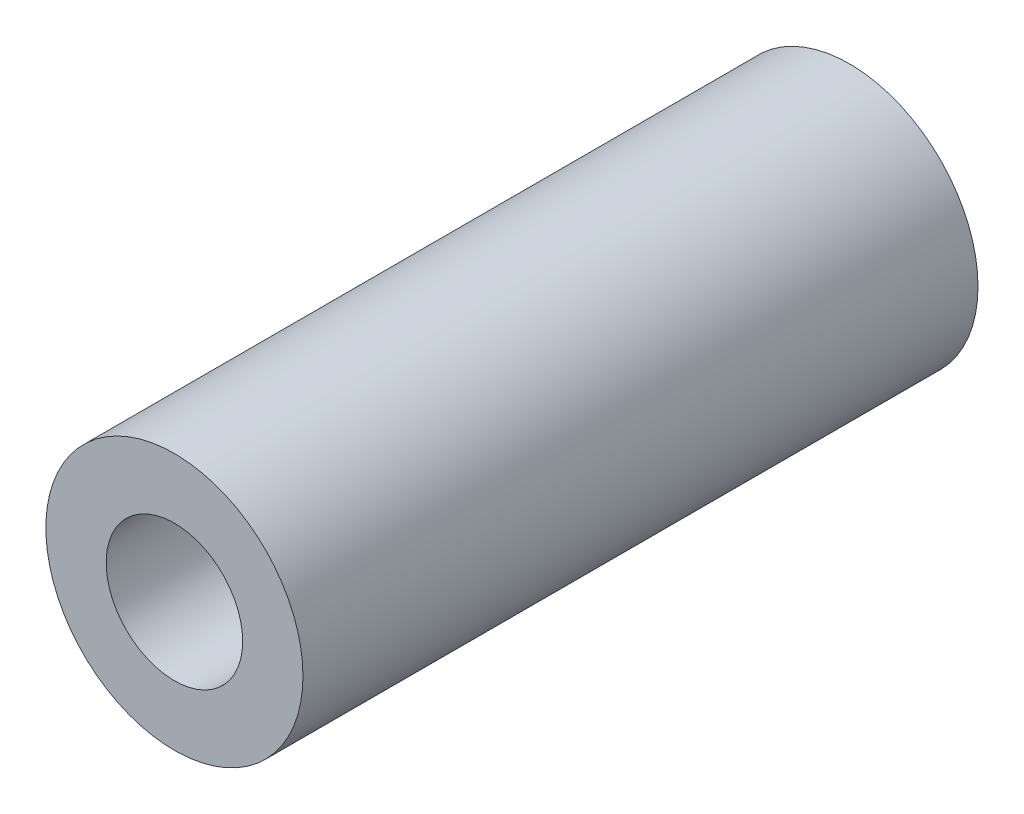
ISO-10303-21;
HEADER;
FILE_DESCRIPTION(('STEP AP214'),'2;1');
FILE_NAME('part.step','',(''),(''),'','','');
FILE_SCHEMA(('AUTOMOTIVE_DESIGN { 1 0 10303 214 1 1 1 1 }'));
ENDSEC;
DATA;
#1=APPLICATION_CONTEXT('core data for automotive mechanical design processes');
#2=APPLICATION_PROTOCOL_DEFINITION('international standard','automotive_design',2000,#1);
#3=PRODUCT_CONTEXT('',#1,'mechanical');
#4=PRODUCT('Part','Part','',(#3));
#5=PRODUCT_RELATED_PRODUCT_CATEGORY('part','',(#4));
#6=PRODUCT_DEFINITION_FORMATION('','',#4);
#7=PRODUCT_DEFINITION_CONTEXT('part definition',#1,'design');
#8=PRODUCT_DEFINITION('design','',#6,#7);
#9=PRODUCT_DEFINITION_SHAPE('','',#8);
#10=(LENGTH_UNIT() NAMED_UNIT(*) SI_UNIT(.MILLI.,.METRE.));
#11=(NAMED_UNIT(*) PLANE_ANGLE_UNIT() SI_UNIT($,.RADIAN.));
#12=(NAMED_UNIT(*) SI_UNIT($,.STERADIAN.) SOLID_ANGLE_UNIT());
#13=UNCERTAINTY_MEASURE_WITH_UNIT(LENGTH_MEASURE(1.E-05),#10,'distance_accuracy_value','');
#14=(GEOMETRIC_REPRESENTATION_CONTEXT(3) GLOBAL_UNCERTAINTY_ASSIGNED_CONTEXT((#13)) GLOBAL_UNIT_ASSIGNED_CONTEXT((#10,
#11,#12)) REPRESENTATION_CONTEXT('',''));
#15=CARTESIAN_POINT('',(0.,0.,0.));
#16=DIRECTION('',(0.,0.,1.));
#17=DIRECTION('',(1.,0.,0.));
#18=AXIS2_PLACEMENT_3D('',#15,#16,#17);
#19=CARTESIAN_POINT('',(0.,0.,89.));
#20=DIRECTION('',(0.,0.,1.));
#21=DIRECTION('',(1.,0.,0.));
#22=AXIS2_PLACEMENT_3D('',#19,#20,#21);
#23=PLANE('',#22);
#24=CARTESIAN_POINT('',(0.,0.,89.));
#25=DIRECTION('',(0.,0.,1.));
#26=DIRECTION('',(1.,0.,0.));
#27=AXIS2_PLACEMENT_3D('',#24,#25,#26);
#28=CIRCLE('',#27,16.95);
#29=CARTESIAN_POINT('',(16.95,0.,89.));
#30=VERTEX_POINT('',#29);
#31=EDGE_CURVE('E12',#30,#30,#28,.T.);
#32=ORIENTED_EDGE('',*,*,#31,.T.);
#33=EDGE_LOOP('',(#32));
#34=FACE_BOUND('',#33,.T.);
#35=CARTESIAN_POINT('',(0.,0.,89.));
#36=DIRECTION('',(0.,0.,1.));
#37=DIRECTION('',(1.,0.,0.));
#38=AXIS2_PLACEMENT_3D('',#35,#36,#37);
#39=CIRCLE('',#38,9.);
#40=CARTESIAN_POINT('',(9.,0.,89.));
#41=VERTEX_POINT('',#40);
#42=EDGE_CURVE('E51',#41,#41,#39,.T.);
#43=ORIENTED_EDGE('',*,*,#42,.F.);
#44=EDGE_LOOP('',(#43));
#45=FACE_BOUND('',#44,.T.);
#46=ADVANCED_FACE('F40',(#34,#45),#23,.T.);
#47=CARTESIAN_POINT('',(0.,0.,0.));
#48=DIRECTION('',(0.,0.,1.));
#49=DIRECTION('',(1.,0.,0.));
#50=AXIS2_PLACEMENT_3D('',#47,#48,#49);
#51=PLANE('',#50);
#52=CARTESIAN_POINT('',(0.,0.,0.));
#53=DIRECTION('',(0.,0.,1.));
#54=DIRECTION('',(1.,0.,0.));
#55=AXIS2_PLACEMENT_3D('',#52,#53,#54);
#56=CIRCLE('',#55,16.95);
#57=CARTESIAN_POINT('',(16.95,0.,0.));
#58=VERTEX_POINT('',#57);
#59=EDGE_CURVE('E44',#58,#58,#56,.T.);
#60=ORIENTED_EDGE('',*,*,#59,.F.);
#61=EDGE_LOOP('',(#60));
#62=FACE_BOUND('',#61,.T.);
#63=CARTESIAN_POINT('',(0.,0.,0.));
#64=DIRECTION('',(0.,0.,1.));
#65=DIRECTION('',(1.,0.,0.));
#66=AXIS2_PLACEMENT_3D('',#63,#64,#65);
#67=CIRCLE('',#66,9.);
#68=CARTESIAN_POINT('',(9.,0.,0.));
#69=VERTEX_POINT('',#68);
#70=EDGE_CURVE('E53',#69,#69,#67,.T.);
#71=ORIENTED_EDGE('',*,*,#70,.T.);
#72=EDGE_LOOP('',(#71));
#73=FACE_BOUND('',#72,.T.);
#74=ADVANCED_FACE('F63',(#62,#73),#51,.F.);
#75=CARTESIAN_POINT('',(0.,0.,89.));
#76=DIRECTION('',(0.,0.,-1.));
#77=DIRECTION('',(-1.,0.,0.));
#78=AXIS2_PLACEMENT_3D('',#75,#76,#77);
#79=CYLINDRICAL_SURFACE('',#78,16.95);
#80=ORIENTED_EDGE('',*,*,#31,.F.);
#81=EDGE_LOOP('',(#80));
#82=FACE_BOUND('',#81,.T.);
#83=ORIENTED_EDGE('',*,*,#59,.T.);
#84=EDGE_LOOP('',(#83));
#85=FACE_BOUND('',#84,.T.);
#86=ADVANCED_FACE('F42',(#82,#85),#79,.T.);
#87=CARTESIAN_POINT('',(0.,0.,89.));
#88=DIRECTION('',(0.,0.,-1.));
#89=DIRECTION('',(-1.,0.,0.));
#90=AXIS2_PLACEMENT_3D('',#87,#88,#89);
#91=CYLINDRICAL_SURFACE('',#90,9.);
#92=ORIENTED_EDGE('',*,*,#42,.T.);
#93=EDGE_LOOP('',(#92));
#94=FACE_BOUND('',#93,.T.);
#95=ORIENTED_EDGE('',*,*,#70,.F.);
#96=EDGE_LOOP('',(#95));
#97=FACE_BOUND('',#96,.T.);
#98=ADVANCED_FACE('F59',(#94,#97),#91,.F.);
#99=CLOSED_SHELL('',(#46,#74,#86,#98));
#100=MANIFOLD_SOLID_BREP('B2',#99);
#101=ADVANCED_BREP_SHAPE_REPRESENTATION('',(#18,#100),#14);
#102=SHAPE_DEFINITION_REPRESENTATION(#9,#101);
ENDSEC;
END-ISO-10303-21;
